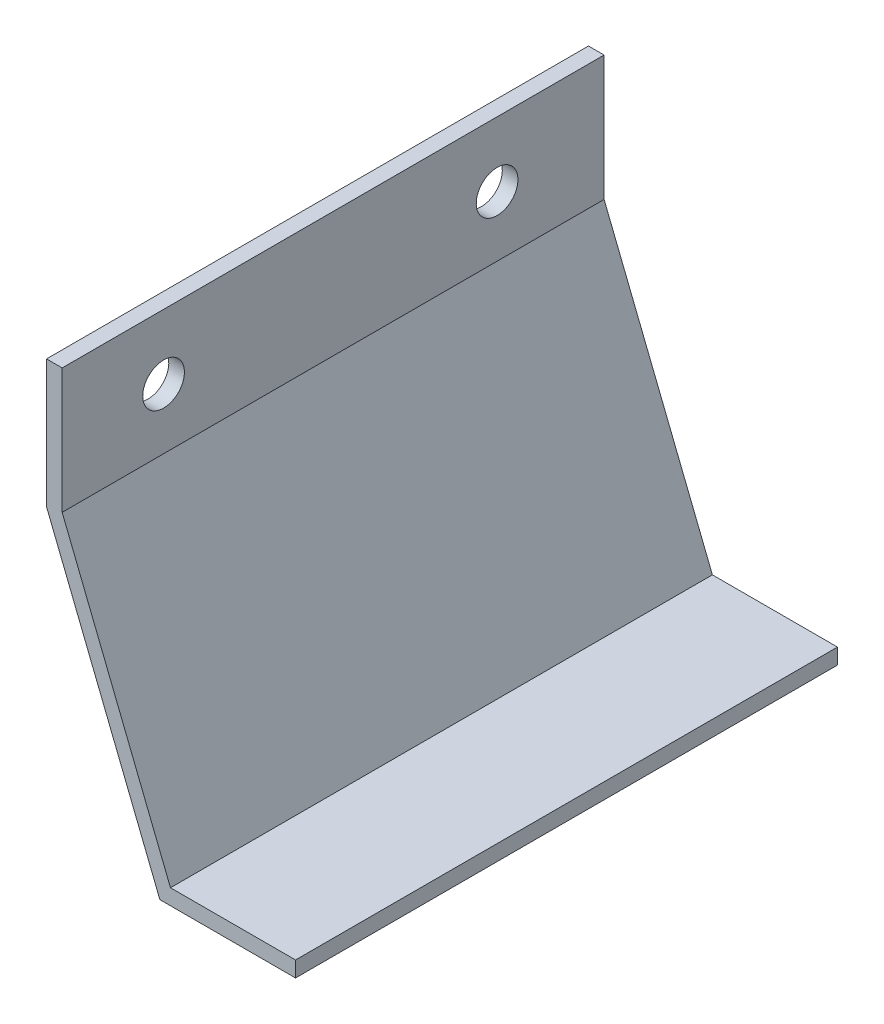
ISO-10303-21;
HEADER;
FILE_DESCRIPTION(('STEP AP214'),'2;1');
FILE_NAME('part.step','',(''),(''),'','','');
FILE_SCHEMA(('AUTOMOTIVE_DESIGN { 1 0 10303 214 1 1 1 1 }'));
ENDSEC;
DATA;
#1=APPLICATION_CONTEXT('core data for automotive mechanical design processes');
#2=APPLICATION_PROTOCOL_DEFINITION('international standard','automotive_design',2000,#1);
#3=PRODUCT_CONTEXT('',#1,'mechanical');
#4=PRODUCT('Part','Part','',(#3));
#5=PRODUCT_RELATED_PRODUCT_CATEGORY('part','',(#4));
#6=PRODUCT_DEFINITION_FORMATION('','',#4);
#7=PRODUCT_DEFINITION_CONTEXT('part definition',#1,'design');
#8=PRODUCT_DEFINITION('design','',#6,#7);
#9=PRODUCT_DEFINITION_SHAPE('','',#8);
#10=(LENGTH_UNIT() NAMED_UNIT(*) SI_UNIT(.MILLI.,.METRE.));
#11=(NAMED_UNIT(*) PLANE_ANGLE_UNIT() SI_UNIT($,.RADIAN.));
#12=(NAMED_UNIT(*) SI_UNIT($,.STERADIAN.) SOLID_ANGLE_UNIT());
#13=UNCERTAINTY_MEASURE_WITH_UNIT(LENGTH_MEASURE(1.E-05),#10,'distance_accuracy_value','');
#14=(GEOMETRIC_REPRESENTATION_CONTEXT(3) GLOBAL_UNCERTAINTY_ASSIGNED_CONTEXT((#13)) GLOBAL_UNIT_ASSIGNED_CONTEXT((#10,
#11,#12)) REPRESENTATION_CONTEXT('',''));
#15=CARTESIAN_POINT('',(0.,0.,0.));
#16=DIRECTION('',(0.,0.,1.));
#17=DIRECTION('',(1.,0.,0.));
#18=AXIS2_PLACEMENT_3D('',#15,#16,#17);
#19=CARTESIAN_POINT('',(32.9955678841871,-4.7625,165.1));
#20=DIRECTION('',(0.,1.,0.));
#21=DIRECTION('',(0.,0.,1.));
#22=AXIS2_PLACEMENT_3D('',#19,#20,#21);
#23=PLANE('',#22);
#24=DIRECTION('',(1.,0.,0.));
#25=VECTOR('',#24,1.);
#26=CARTESIAN_POINT('',(32.9955678841871,-4.7625,0.));
#27=LINE('',#26,#25);
#28=CARTESIAN_POINT('',(29.7703121851979,-4.7625,0.));
#29=VERTEX_POINT('',#28);
#30=CARTESIAN_POINT('',(71.0955678841871,-4.7625,0.));
#31=VERTEX_POINT('',#30);
#32=EDGE_CURVE('E142',#29,#31,#27,.T.);
#33=ORIENTED_EDGE('',*,*,#32,.T.);
#34=DIRECTION('',(0.,0.,-1.));
#35=VECTOR('',#34,1.);
#36=CARTESIAN_POINT('',(71.0955678841871,-4.7625,165.1));
#37=LINE('',#36,#35);
#38=CARTESIAN_POINT('',(71.0955678841871,-4.7625,165.1));
#39=VERTEX_POINT('',#38);
#40=EDGE_CURVE('E11',#39,#31,#37,.T.);
#41=ORIENTED_EDGE('',*,*,#40,.F.);
#42=DIRECTION('',(1.,0.,0.));
#43=VECTOR('',#42,1.);
#44=CARTESIAN_POINT('',(32.9955678841871,-4.7625,165.1));
#45=LINE('',#44,#43);
#46=CARTESIAN_POINT('',(29.7703121851979,-4.7625,165.1));
#47=VERTEX_POINT('',#46);
#48=EDGE_CURVE('E95',#47,#39,#45,.T.);
#49=ORIENTED_EDGE('',*,*,#48,.F.);
#50=DIRECTION('',(0.,0.,-1.));
#51=VECTOR('',#50,1.);
#52=CARTESIAN_POINT('',(29.7703121851979,-4.7625,165.1));
#53=LINE('',#52,#51);
#54=EDGE_CURVE('E141',#47,#29,#53,.T.);
#55=ORIENTED_EDGE('',*,*,#54,.T.);
#56=EDGE_LOOP('',(#33,#41,#49,#55));
#57=FACE_BOUND('',#56,.T.);
#58=ADVANCED_FACE('F39',(#57),#23,.F.);
#59=CARTESIAN_POINT('',(71.0955678841871,0.,165.1));
#60=DIRECTION('',(1.,0.,0.));
#61=DIRECTION('',(0.,1.,0.));
#62=AXIS2_PLACEMENT_3D('',#59,#60,#61);
#63=PLANE('',#62);
#64=DIRECTION('',(0.,-1.,0.));
#65=VECTOR('',#64,1.);
#66=CARTESIAN_POINT('',(71.0955678841871,0.,0.));
#67=LINE('',#66,#65);
#68=CARTESIAN_POINT('',(71.0955678841871,0.,0.));
#69=VERTEX_POINT('',#68);
#70=EDGE_CURVE('E146',#69,#31,#67,.T.);
#71=ORIENTED_EDGE('',*,*,#70,.F.);
#72=DIRECTION('',(0.,0.,-1.));
#73=VECTOR('',#72,1.);
#74=CARTESIAN_POINT('',(71.0955678841871,0.,165.1));
#75=LINE('',#74,#73);
#76=CARTESIAN_POINT('',(71.0955678841871,0.,165.1));
#77=VERTEX_POINT('',#76);
#78=EDGE_CURVE('E48',#77,#69,#75,.T.);
#79=ORIENTED_EDGE('',*,*,#78,.F.);
#80=DIRECTION('',(0.,-1.,0.));
#81=VECTOR('',#80,1.);
#82=CARTESIAN_POINT('',(71.0955678841871,0.,165.1));
#83=LINE('',#82,#81);
#84=EDGE_CURVE('E199',#77,#39,#83,.T.);
#85=ORIENTED_EDGE('',*,*,#84,.T.);
#86=ORIENTED_EDGE('',*,*,#40,.T.);
#87=EDGE_LOOP('',(#71,#79,#85,#86));
#88=FACE_BOUND('',#87,.T.);
#89=ADVANCED_FACE('F190',(#88),#63,.T.);
#90=CARTESIAN_POINT('',(32.9955678841871,0.,165.1));
#91=DIRECTION('',(0.,1.,0.));
#92=DIRECTION('',(0.,0.,1.));
#93=AXIS2_PLACEMENT_3D('',#90,#91,#92);
#94=PLANE('',#93);
#95=DIRECTION('',(1.,0.,0.));
#96=VECTOR('',#95,1.);
#97=CARTESIAN_POINT('',(32.9955678841871,0.,0.));
#98=LINE('',#97,#96);
#99=CARTESIAN_POINT('',(32.9955678841871,0.,0.));
#100=VERTEX_POINT('',#99);
#101=EDGE_CURVE('E151',#100,#69,#98,.T.);
#102=ORIENTED_EDGE('',*,*,#101,.F.);
#103=DIRECTION('',(0.,0.,-1.));
#104=VECTOR('',#103,1.);
#105=CARTESIAN_POINT('',(32.9955678841871,0.,165.1));
#106=LINE('',#105,#104);
#107=CARTESIAN_POINT('',(32.9955678841871,0.,165.1));
#108=VERTEX_POINT('',#107);
#109=EDGE_CURVE('E178',#108,#100,#106,.T.);
#110=ORIENTED_EDGE('',*,*,#109,.F.);
#111=DIRECTION('',(1.,0.,0.));
#112=VECTOR('',#111,1.);
#113=CARTESIAN_POINT('',(32.9955678841871,0.,165.1));
#114=LINE('',#113,#112);
#115=EDGE_CURVE('E187',#108,#77,#114,.T.);
#116=ORIENTED_EDGE('',*,*,#115,.T.);
#117=ORIENTED_EDGE('',*,*,#78,.T.);
#118=EDGE_LOOP('',(#102,#110,#116,#117));
#119=FACE_BOUND('',#118,.T.);
#120=ADVANCED_FACE('F185',(#119),#94,.T.);
#121=CARTESIAN_POINT('',(0.,82.55,165.1));
#122=DIRECTION('',(0.928571428571429,0.371153744479045,0.));
#123=DIRECTION('',(-0.371153744479045,0.928571428571429,0.));
#124=AXIS2_PLACEMENT_3D('',#121,#122,#123);
#125=PLANE('',#124);
#126=DIRECTION('',(0.371153744479045,-0.928571428571429,0.));
#127=VECTOR('',#126,1.);
#128=CARTESIAN_POINT('',(0.,82.55,0.));
#129=LINE('',#128,#127);
#130=CARTESIAN_POINT('',(0.,82.55,0.));
#131=VERTEX_POINT('',#130);
#132=EDGE_CURVE('E155',#131,#100,#129,.T.);
#133=ORIENTED_EDGE('',*,*,#132,.F.);
#134=DIRECTION('',(0.,0.,-1.));
#135=VECTOR('',#134,1.);
#136=CARTESIAN_POINT('',(0.,82.55,165.1));
#137=LINE('',#136,#135);
#138=CARTESIAN_POINT('',(0.,82.55,165.1));
#139=VERTEX_POINT('',#138);
#140=EDGE_CURVE('E175',#139,#131,#137,.T.);
#141=ORIENTED_EDGE('',*,*,#140,.F.);
#142=DIRECTION('',(0.371153744479045,-0.928571428571429,0.));
#143=VECTOR('',#142,1.);
#144=CARTESIAN_POINT('',(0.,82.55,165.1));
#145=LINE('',#144,#143);
#146=EDGE_CURVE('E135',#139,#108,#145,.T.);
#147=ORIENTED_EDGE('',*,*,#146,.T.);
#148=ORIENTED_EDGE('',*,*,#109,.T.);
#149=EDGE_LOOP('',(#133,#141,#147,#148));
#150=FACE_BOUND('',#149,.T.);
#151=ADVANCED_FACE('F197',(#150),#125,.T.);
#152=CARTESIAN_POINT('',(0.,120.65,165.1));
#153=DIRECTION('',(1.,0.,0.));
#154=DIRECTION('',(0.,1.,0.));
#155=AXIS2_PLACEMENT_3D('',#152,#153,#154);
#156=PLANE('',#155);
#157=CARTESIAN_POINT('',(0.,100.942277040049,134.204880656957));
#158=DIRECTION('',(1.,0.,0.));
#159=DIRECTION('',(0.,1.,0.));
#160=AXIS2_PLACEMENT_3D('',#157,#158,#159);
#161=CIRCLE('',#160,6.34999999999999);
#162=CARTESIAN_POINT('',(0.,107.292277040049,134.204880656957));
#163=VERTEX_POINT('',#162);
#164=EDGE_CURVE('E216',#163,#163,#161,.T.);
#165=ORIENTED_EDGE('',*,*,#164,.F.);
#166=EDGE_LOOP('',(#165));
#167=FACE_BOUND('',#166,.T.);
#168=CARTESIAN_POINT('',(0.,100.942277040049,32.6048806569568));
#169=DIRECTION('',(1.,0.,0.));
#170=DIRECTION('',(0.,1.,0.));
#171=AXIS2_PLACEMENT_3D('',#168,#169,#170);
#172=CIRCLE('',#171,6.35);
#173=CARTESIAN_POINT('',(0.,107.292277040049,32.6048806569568));
#174=VERTEX_POINT('',#173);
#175=EDGE_CURVE('E208',#174,#174,#172,.T.);
#176=ORIENTED_EDGE('',*,*,#175,.F.);
#177=EDGE_LOOP('',(#176));
#178=FACE_BOUND('',#177,.T.);
#179=DIRECTION('',(0.,-1.,0.));
#180=VECTOR('',#179,1.);
#181=CARTESIAN_POINT('',(0.,120.65,0.));
#182=LINE('',#181,#180);
#183=CARTESIAN_POINT('',(0.,120.65,0.));
#184=VERTEX_POINT('',#183);
#185=EDGE_CURVE('E159',#184,#131,#182,.T.);
#186=ORIENTED_EDGE('',*,*,#185,.F.);
#187=DIRECTION('',(0.,0.,-1.));
#188=VECTOR('',#187,1.);
#189=CARTESIAN_POINT('',(0.,120.65,165.1));
#190=LINE('',#189,#188);
#191=CARTESIAN_POINT('',(0.,120.65,165.1));
#192=VERTEX_POINT('',#191);
#193=EDGE_CURVE('E120',#192,#184,#190,.T.);
#194=ORIENTED_EDGE('',*,*,#193,.F.);
#195=DIRECTION('',(0.,-1.,0.));
#196=VECTOR('',#195,1.);
#197=CARTESIAN_POINT('',(0.,120.65,165.1));
#198=LINE('',#197,#196);
#199=EDGE_CURVE('E131',#192,#139,#198,.T.);
#200=ORIENTED_EDGE('',*,*,#199,.T.);
#201=ORIENTED_EDGE('',*,*,#140,.T.);
#202=EDGE_LOOP('',(#186,#194,#200,#201));
#203=FACE_BOUND('',#202,.T.);
#204=ADVANCED_FACE('F233',(#167,#178,#203),#156,.T.);
#205=CARTESIAN_POINT('',(-4.7625,120.65,165.1));
#206=DIRECTION('',(0.,1.,0.));
#207=DIRECTION('',(0.,0.,1.));
#208=AXIS2_PLACEMENT_3D('',#205,#206,#207);
#209=PLANE('',#208);
#210=DIRECTION('',(1.,0.,0.));
#211=VECTOR('',#210,1.);
#212=CARTESIAN_POINT('',(-4.7625,120.65,0.));
#213=LINE('',#212,#211);
#214=CARTESIAN_POINT('',(-4.7625,120.65,0.));
#215=VERTEX_POINT('',#214);
#216=EDGE_CURVE('E118',#215,#184,#213,.T.);
#217=ORIENTED_EDGE('',*,*,#216,.F.);
#218=DIRECTION('',(0.,0.,-1.));
#219=VECTOR('',#218,1.);
#220=CARTESIAN_POINT('',(-4.7625,120.65,165.1));
#221=LINE('',#220,#219);
#222=CARTESIAN_POINT('',(-4.7625,120.65,165.1));
#223=VERTEX_POINT('',#222);
#224=EDGE_CURVE('E112',#223,#215,#221,.T.);
#225=ORIENTED_EDGE('',*,*,#224,.F.);
#226=DIRECTION('',(1.,0.,0.));
#227=VECTOR('',#226,1.);
#228=CARTESIAN_POINT('',(-4.7625,120.65,165.1));
#229=LINE('',#228,#227);
#230=EDGE_CURVE('E116',#223,#192,#229,.T.);
#231=ORIENTED_EDGE('',*,*,#230,.T.);
#232=ORIENTED_EDGE('',*,*,#193,.T.);
#233=EDGE_LOOP('',(#217,#225,#231,#232));
#234=FACE_BOUND('',#233,.T.);
#235=ADVANCED_FACE('F114',(#234),#209,.T.);
#236=CARTESIAN_POINT('',(-4.7625,120.65,165.1));
#237=DIRECTION('',(1.,0.,0.));
#238=DIRECTION('',(0.,1.,0.));
#239=AXIS2_PLACEMENT_3D('',#236,#237,#238);
#240=PLANE('',#239);
#241=CARTESIAN_POINT('',(-4.76250000000001,100.942277040049,134.204880656957));
#242=DIRECTION('',(1.,0.,0.));
#243=DIRECTION('',(0.,1.,0.));
#244=AXIS2_PLACEMENT_3D('',#241,#242,#243);
#245=CIRCLE('',#244,6.34999999999999);
#246=CARTESIAN_POINT('',(-4.76250000000001,107.292277040049,134.204880656957));
#247=VERTEX_POINT('',#246);
#248=EDGE_CURVE('E147',#247,#247,#245,.T.);
#249=ORIENTED_EDGE('',*,*,#248,.T.);
#250=EDGE_LOOP('',(#249));
#251=FACE_BOUND('',#250,.T.);
#252=CARTESIAN_POINT('',(-4.76250000000001,100.942277040049,32.6048806569568));
#253=DIRECTION('',(1.,0.,0.));
#254=DIRECTION('',(0.,1.,0.));
#255=AXIS2_PLACEMENT_3D('',#252,#253,#254);
#256=CIRCLE('',#255,6.35);
#257=CARTESIAN_POINT('',(-4.76250000000001,107.292277040049,32.6048806569568));
#258=VERTEX_POINT('',#257);
#259=EDGE_CURVE('E212',#258,#258,#256,.T.);
#260=ORIENTED_EDGE('',*,*,#259,.T.);
#261=EDGE_LOOP('',(#260));
#262=FACE_BOUND('',#261,.T.);
#263=DIRECTION('',(0.,-1.,0.));
#264=VECTOR('',#263,1.);
#265=CARTESIAN_POINT('',(-4.7625,120.65,0.));
#266=LINE('',#265,#264);
#267=CARTESIAN_POINT('',(-4.76249999999999,81.6334564476615,0.));
#268=VERTEX_POINT('',#267);
#269=EDGE_CURVE('E83',#215,#268,#266,.T.);
#270=ORIENTED_EDGE('',*,*,#269,.T.);
#271=DIRECTION('',(0.,0.,-1.));
#272=VECTOR('',#271,1.);
#273=CARTESIAN_POINT('',(-4.76249999999999,81.6334564476615,165.1));
#274=LINE('',#273,#272);
#275=CARTESIAN_POINT('',(-4.76249999999999,81.6334564476615,165.1));
#276=VERTEX_POINT('',#275);
#277=EDGE_CURVE('E121',#276,#268,#274,.T.);
#278=ORIENTED_EDGE('',*,*,#277,.F.);
#279=DIRECTION('',(0.,-1.,0.));
#280=VECTOR('',#279,1.);
#281=CARTESIAN_POINT('',(-4.7625,120.65,165.1));
#282=LINE('',#281,#280);
#283=EDGE_CURVE('E123',#223,#276,#282,.T.);
#284=ORIENTED_EDGE('',*,*,#283,.F.);
#285=ORIENTED_EDGE('',*,*,#224,.T.);
#286=EDGE_LOOP('',(#270,#278,#284,#285));
#287=FACE_BOUND('',#286,.T.);
#288=ADVANCED_FACE('F124',(#251,#262,#287),#240,.F.);
#289=CARTESIAN_POINT('',(-4.42232142857143,80.7823802919185,165.1));
#290=DIRECTION('',(0.928571428571429,0.371153744479045,0.));
#291=DIRECTION('',(-0.371153744479045,0.928571428571429,0.));
#292=AXIS2_PLACEMENT_3D('',#289,#290,#291);
#293=PLANE('',#292);
#294=DIRECTION('',(0.371153744479045,-0.928571428571429,0.));
#295=VECTOR('',#294,1.);
#296=CARTESIAN_POINT('',(-4.42232142857143,80.7823802919185,0.));
#297=LINE('',#296,#295);
#298=EDGE_CURVE('E89',#268,#29,#297,.T.);
#299=ORIENTED_EDGE('',*,*,#298,.T.);
#300=ORIENTED_EDGE('',*,*,#54,.F.);
#301=DIRECTION('',(0.371153744479045,-0.928571428571429,0.));
#302=VECTOR('',#301,1.);
#303=CARTESIAN_POINT('',(-4.42232142857143,80.7823802919185,165.1));
#304=LINE('',#303,#302);
#305=EDGE_CURVE('E56',#276,#47,#304,.T.);
#306=ORIENTED_EDGE('',*,*,#305,.F.);
#307=ORIENTED_EDGE('',*,*,#277,.T.);
#308=EDGE_LOOP('',(#299,#300,#306,#307));
#309=FACE_BOUND('',#308,.T.);
#310=ADVANCED_FACE('F240',(#309),#293,.F.);
#311=CARTESIAN_POINT('',(0.,0.,165.1));
#312=DIRECTION('',(0.,0.,-1.));
#313=DIRECTION('',(-1.,0.,0.));
#314=AXIS2_PLACEMENT_3D('',#311,#312,#313);
#315=PLANE('',#314);
#316=ORIENTED_EDGE('',*,*,#48,.T.);
#317=ORIENTED_EDGE('',*,*,#84,.F.);
#318=ORIENTED_EDGE('',*,*,#115,.F.);
#319=ORIENTED_EDGE('',*,*,#146,.F.);
#320=ORIENTED_EDGE('',*,*,#199,.F.);
#321=ORIENTED_EDGE('',*,*,#230,.F.);
#322=ORIENTED_EDGE('',*,*,#283,.T.);
#323=ORIENTED_EDGE('',*,*,#305,.T.);
#324=EDGE_LOOP('',(#316,#317,#318,#319,#320,#321,#322,#323));
#325=FACE_BOUND('',#324,.T.);
#326=ADVANCED_FACE('F128',(#325),#315,.F.);
#327=CARTESIAN_POINT('',(0.,0.,0.));
#328=DIRECTION('',(0.,0.,-1.));
#329=DIRECTION('',(-1.,0.,0.));
#330=AXIS2_PLACEMENT_3D('',#327,#328,#329);
#331=PLANE('',#330);
#332=ORIENTED_EDGE('',*,*,#32,.F.);
#333=ORIENTED_EDGE('',*,*,#298,.F.);
#334=ORIENTED_EDGE('',*,*,#269,.F.);
#335=ORIENTED_EDGE('',*,*,#216,.T.);
#336=ORIENTED_EDGE('',*,*,#185,.T.);
#337=ORIENTED_EDGE('',*,*,#132,.T.);
#338=ORIENTED_EDGE('',*,*,#101,.T.);
#339=ORIENTED_EDGE('',*,*,#70,.T.);
#340=EDGE_LOOP('',(#332,#333,#334,#335,#336,#337,#338,#339));
#341=FACE_BOUND('',#340,.T.);
#342=ADVANCED_FACE('F193',(#341),#331,.T.);
#343=CARTESIAN_POINT('',(-4.76250000000001,100.942277040049,32.6048806569568));
#344=DIRECTION('',(1.,0.,0.));
#345=DIRECTION('',(0.,1.,0.));
#346=AXIS2_PLACEMENT_3D('',#343,#344,#345);
#347=CYLINDRICAL_SURFACE('',#346,6.35);
#348=ORIENTED_EDGE('',*,*,#259,.F.);
#349=EDGE_LOOP('',(#348));
#350=FACE_BOUND('',#349,.T.);
#351=ORIENTED_EDGE('',*,*,#175,.T.);
#352=EDGE_LOOP('',(#351));
#353=FACE_BOUND('',#352,.T.);
#354=ADVANCED_FACE('F229',(#350,#353),#347,.F.);
#355=CARTESIAN_POINT('',(-4.76250000000001,100.942277040049,134.204880656957));
#356=DIRECTION('',(1.,0.,0.));
#357=DIRECTION('',(0.,1.,0.));
#358=AXIS2_PLACEMENT_3D('',#355,#356,#357);
#359=CYLINDRICAL_SURFACE('',#358,6.34999999999999);
#360=ORIENTED_EDGE('',*,*,#248,.F.);
#361=EDGE_LOOP('',(#360));
#362=FACE_BOUND('',#361,.T.);
#363=ORIENTED_EDGE('',*,*,#164,.T.);
#364=EDGE_LOOP('',(#363));
#365=FACE_BOUND('',#364,.T.);
#366=ADVANCED_FACE('F226',(#362,#365),#359,.F.);
#367=CLOSED_SHELL('',(#58,#89,#120,#151,#204,#235,#288,#310,#326,#342,#354,#366));
#368=MANIFOLD_SOLID_BREP('B2',#367);
#369=ADVANCED_BREP_SHAPE_REPRESENTATION('',(#18,#368),#14);
#370=SHAPE_DEFINITION_REPRESENTATION(#9,#369);
ENDSEC;
END-ISO-10303-21;
